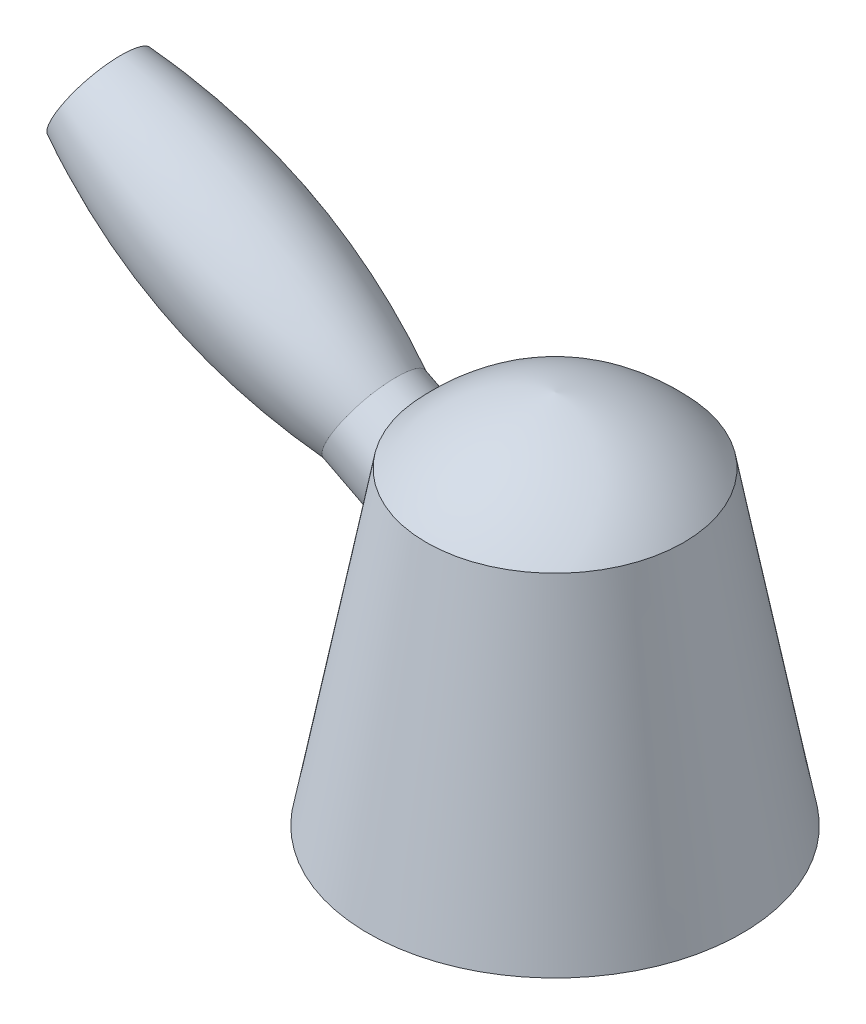
ISO-10303-21;
HEADER;
FILE_DESCRIPTION(('STEP AP214'),'2;1');
FILE_NAME('part.step','',(''),(''),'','','');
FILE_SCHEMA(('AUTOMOTIVE_DESIGN { 1 0 10303 214 1 1 1 1 }'));
ENDSEC;
DATA;
#1=APPLICATION_CONTEXT('core data for automotive mechanical design processes');
#2=APPLICATION_PROTOCOL_DEFINITION('international standard','automotive_design',2000,#1);
#3=PRODUCT_CONTEXT('',#1,'mechanical');
#4=PRODUCT('Part','Part','',(#3));
#5=PRODUCT_RELATED_PRODUCT_CATEGORY('part','',(#4));
#6=PRODUCT_DEFINITION_FORMATION('','',#4);
#7=PRODUCT_DEFINITION_CONTEXT('part definition',#1,'design');
#8=PRODUCT_DEFINITION('design','',#6,#7);
#9=PRODUCT_DEFINITION_SHAPE('','',#8);
#10=(LENGTH_UNIT() NAMED_UNIT(*) SI_UNIT(.MILLI.,.METRE.));
#11=(NAMED_UNIT(*) PLANE_ANGLE_UNIT() SI_UNIT($,.RADIAN.));
#12=(NAMED_UNIT(*) SI_UNIT($,.STERADIAN.) SOLID_ANGLE_UNIT());
#13=UNCERTAINTY_MEASURE_WITH_UNIT(LENGTH_MEASURE(1.E-05),#10,'distance_accuracy_value','');
#14=(GEOMETRIC_REPRESENTATION_CONTEXT(3) GLOBAL_UNCERTAINTY_ASSIGNED_CONTEXT((#13)) GLOBAL_UNIT_ASSIGNED_CONTEXT((#10,
#11,#12)) REPRESENTATION_CONTEXT('',''));
#15=CARTESIAN_POINT('',(0.,0.,0.));
#16=DIRECTION('',(0.,0.,1.));
#17=DIRECTION('',(1.,0.,0.));
#18=AXIS2_PLACEMENT_3D('',#15,#16,#17);
#19=CARTESIAN_POINT('',(-21.3466135458167,51.3227091633466,0.));
#20=CARTESIAN_POINT('',(-12.7327519919958,60.5934654438864,0.));
#21=CARTESIAN_POINT('',(0.,62.2231075697211,0.));
#22=B_SPLINE_CURVE_WITH_KNOTS('',2,(#19,#20,#21),.UNSPECIFIED.,.F.,.F.,(3,3),(0.,1.),.UNSPECIFIED.);
#23=CARTESIAN_POINT('',(0.,62.2231075697211,0.));
#24=DIRECTION('',(0.,1.,0.));
#25=AXIS1_PLACEMENT('',#23,#24);
#26=SURFACE_OF_REVOLUTION('',#22,#25);
#27=CARTESIAN_POINT('',(0.,62.2231075697211,0.));
#28=VERTEX_POINT('',#27);
#29=VERTEX_LOOP('',#28);
#30=FACE_BOUND('',#29,.T.);
#31=CARTESIAN_POINT('',(0.,51.3227091633466,0.));
#32=DIRECTION('',(0.,1.,0.));
#33=DIRECTION('',(-1.,0.,0.));
#34=AXIS2_PLACEMENT_3D('',#31,#32,#33);
#35=CIRCLE('',#34,21.3466135458167);
#36=CARTESIAN_POINT('',(-21.3466135458167,51.3227091633466,0.));
#37=VERTEX_POINT('',#36);
#38=EDGE_CURVE('E11',#37,#37,#35,.T.);
#39=ORIENTED_EDGE('',*,*,#38,.T.);
#40=EDGE_LOOP('',(#39));
#41=FACE_BOUND('',#40,.T.);
#42=ADVANCED_FACE('F39',(#30,#41),#26,.T.);
#43=CARTESIAN_POINT('',(0.,0.,0.));
#44=DIRECTION('',(0.,-1.,0.));
#45=DIRECTION('',(1.,0.,0.));
#46=AXIS2_PLACEMENT_3D('',#43,#44,#45);
#47=CONICAL_SURFACE('',#46,31.,0.185919697183618);
#48=CARTESIAN_POINT('',(-24.1161501733399,34.0757030325233,-4.80735627525185));
#49=CARTESIAN_POINT('',(-24.0589873401111,34.1948385170334,-4.97948805248401));
#50=CARTESIAN_POINT('',(-23.9995697616349,34.3208311605628,-5.14621009731383));
#51=CARTESIAN_POINT('',(-23.8772410562156,34.5859305183616,-5.46763375845816));
#52=CARTESIAN_POINT('',(-23.8143279268493,34.7250447818414,-5.62232836055807));
#53=CARTESIAN_POINT('',(-23.6859700742553,35.0159671761574,-5.91885726500743));
#54=CARTESIAN_POINT('',(-23.6205202966762,35.1678014331521,-6.06066378643435));
#55=CARTESIAN_POINT('',(-23.4883465077628,35.4830959037464,-6.3300425571355));
#56=CARTESIAN_POINT('',(-23.4216225034295,35.6465560534816,-6.45761488459213));
#57=CARTESIAN_POINT('',(-23.2880597933237,35.9841424752919,-6.697622350267));
#58=CARTESIAN_POINT('',(-23.2212211122437,36.1582666773936,-6.8100604126962));
#59=CARTESIAN_POINT('',(-23.0885489421428,36.5161582644356,-7.0190821608874));
#60=CARTESIAN_POINT('',(-23.0227154881462,36.6999259843918,-7.11566529536727));
#61=CARTESIAN_POINT('',(-22.8931898029493,37.0757821443392,-7.29231606978475));
#62=CARTESIAN_POINT('',(-22.8294960815663,37.2678645709852,-7.3723954118393));
#63=CARTESIAN_POINT('',(-22.7052023198652,37.6591769226697,-7.51570589413672));
#64=CARTESIAN_POINT('',(-22.6446022256677,37.8584067231249,-7.57893732788734));
#65=CARTESIAN_POINT('',(-22.5280156649117,38.2604260286369,-7.68772471473032));
#66=CARTESIAN_POINT('',(-22.4719860419005,38.4631528995176,-7.73346615376614));
#67=CARTESIAN_POINT('',(-22.3645205178933,38.8728590212299,-7.80819990875397));
#68=CARTESIAN_POINT('',(-22.3130845784492,39.0798382364526,-7.83719236490232));
#69=CARTESIAN_POINT('',(-22.2153482941029,39.4966462372187,-7.87855561139602));
#70=CARTESIAN_POINT('',(-22.1690480208931,39.7064750624959,-7.89092616973141));
#71=CARTESIAN_POINT('',(-22.0819364462416,40.1276642938344,-7.8993235053111));
#72=CARTESIAN_POINT('',(-22.0411272458578,40.3390252537235,-7.89534404478365));
#73=CARTESIAN_POINT('',(-21.9641267860377,40.7679373120569,-7.87107447262709));
#74=CARTESIAN_POINT('',(-21.9281015685216,40.9854920629697,-7.85031977067011));
#75=CARTESIAN_POINT('',(-21.8621163433967,41.4193664348352,-7.79243874325677));
#76=CARTESIAN_POINT('',(-21.8321584376166,41.6356856026264,-7.75530675851503));
#77=CARTESIAN_POINT('',(-21.7512603044431,42.280719164139,-7.62019553667005));
#78=CARTESIAN_POINT('',(-21.709247177782,42.7057838094614,-7.49848436591362));
#79=CARTESIAN_POINT('',(-21.6439435620018,43.5727942258543,-7.18311130275072));
#80=CARTESIAN_POINT('',(-21.6226299070347,44.0129251942495,-6.98405275187126));
#81=CARTESIAN_POINT('',(-21.6058898817571,44.6470970770069,-6.63765821491089));
#82=CARTESIAN_POINT('',(-21.6028519147674,44.8543035221287,-6.51410913942469));
#83=CARTESIAN_POINT('',(-21.6011070689309,45.2587950570205,-6.25152557570576));
#84=CARTESIAN_POINT('',(-21.6024008699725,45.4560785844158,-6.11248865990496));
#85=CARTESIAN_POINT('',(-21.6087659807262,45.8531709708044,-5.80882893001133));
#86=CARTESIAN_POINT('',(-21.6141058461551,46.0521151071053,-5.64307972743327));
#87=CARTESIAN_POINT('',(-21.6278559332783,46.4349169281842,-5.29510895305184));
#88=CARTESIAN_POINT('',(-21.6362658817653,46.6187759536068,-5.11288884808273));
#89=CARTESIAN_POINT('',(-21.6550953581274,46.969194748823,-4.73288159180835));
#90=CARTESIAN_POINT('',(-21.6655130776809,47.1357698794162,-4.5351085426129));
#91=CARTESIAN_POINT('',(-21.6872907855028,47.4495249663692,-4.12480198404761));
#92=CARTESIAN_POINT('',(-21.6986504911345,47.5967107063229,-3.91227290521883));
#93=CARTESIAN_POINT('',(-21.7187315986065,47.8389590838952,-3.52251634130378));
#94=CARTESIAN_POINT('',(-21.7274775370713,47.9383318913569,-3.34795845582806));
#95=CARTESIAN_POINT('',(-21.7444114602224,48.1227633108617,-2.99142755648769));
#96=CARTESIAN_POINT('',(-21.7525995644167,48.2078249946334,-2.8094561442991));
#97=CARTESIAN_POINT('',(-21.7679606641993,48.3624696861177,-2.43913697741319));
#98=CARTESIAN_POINT('',(-21.7751343332188,48.4320629802118,-2.25079355667079));
#99=CARTESIAN_POINT('',(-21.7880711764065,48.5548074297072,-1.86875421965951));
#100=CARTESIAN_POINT('',(-21.7938343209261,48.6079582395018,-1.67505819097671));
#101=CARTESIAN_POINT('',(-21.8036438507222,48.6971538473605,-1.2827264146136));
#102=CARTESIAN_POINT('',(-21.8076818214522,48.7331149012209,-1.08407134732806));
#103=CARTESIAN_POINT('',(-21.8137628315751,48.7869040390191,-0.684282320567605));
#104=CARTESIAN_POINT('',(-21.8158058727407,48.804732139068,-0.483148363295352));
#105=CARTESIAN_POINT('',(-21.8177751631013,48.8219205477246,-0.0801042609735322));
#106=CARTESIAN_POINT('',(-21.8177016583799,48.8212830032683,0.121805791112863));
#107=CARTESIAN_POINT('',(-21.8154425727082,48.8015562879095,0.524701576991352));
#108=CARTESIAN_POINT('',(-21.8132571008227,48.7824680698232,0.72568735797547));
#109=CARTESIAN_POINT('',(-21.807155926004,48.7284210414754,1.10932302349286));
#110=CARTESIAN_POINT('',(-21.8033900711112,48.69483077206,1.29217018348536));
#111=CARTESIAN_POINT('',(-21.7943648351628,48.6127970611276,1.65452364071118));
#112=CARTESIAN_POINT('',(-21.789104948253,48.5643485884275,1.83402878442157));
#113=CARTESIAN_POINT('',(-21.7773516958927,48.4533030833518,2.18850156107614));
#114=CARTESIAN_POINT('',(-21.7708586576764,48.3907098036661,2.36347038382961));
#115=CARTESIAN_POINT('',(-21.7569485933456,48.2521544363249,2.70805566350788));
#116=CARTESIAN_POINT('',(-21.749531210383,48.176187180877,2.8776700214457));
#117=CARTESIAN_POINT('',(-21.7337385234596,48.007641132387,3.21908881711108));
#118=CARTESIAN_POINT('',(-21.7253338035002,47.9144190160805,3.39057433111699));
#119=CARTESIAN_POINT('',(-21.7083330115605,47.7152615910462,3.72601509965161));
#120=CARTESIAN_POINT('',(-21.699736874959,47.6093219342738,3.88996775210129));
#121=CARTESIAN_POINT('',(-21.6743451449699,47.2740208651467,4.36957814324569));
#122=CARTESIAN_POINT('',(-21.6579385427152,47.0271017401529,4.67313896676247));
#123=CARTESIAN_POINT('',(-21.6277866443387,46.4545265904836,5.287054886081));
#124=CARTESIAN_POINT('',(-21.6148086053516,46.1226163847999,5.59161108539678));
#125=CARTESIAN_POINT('',(-21.6041396567315,45.5944058415615,6.00982484304371));
#126=CARTESIAN_POINT('',(-21.6020512416507,45.4131470382189,6.14286851872794));
#127=CARTESIAN_POINT('',(-21.6014487956726,45.0415293229493,6.39572825230629));
#128=CARTESIAN_POINT('',(-21.6029352924788,44.8511690715956,6.515542354613));
#129=CARTESIAN_POINT('',(-21.6105653136848,44.4372911943711,6.75609938982102));
#130=CARTESIAN_POINT('',(-21.6172886000372,44.2126781742624,6.87494196006096));
#131=CARTESIAN_POINT('',(-21.6368971364134,43.7550248507971,7.09432127909431));
#132=CARTESIAN_POINT('',(-21.6497804729025,43.5219871852068,7.19486369919532));
#133=CARTESIAN_POINT('',(-21.682432036346,43.0489076952448,7.37693724940439));
#134=CARTESIAN_POINT('',(-21.7022040107885,42.8088621237585,7.45845799114125));
#135=CARTESIAN_POINT('',(-21.7491999725808,42.3237078348687,7.60151736907415));
#136=CARTESIAN_POINT('',(-21.7764204919773,42.078601522665,7.66306527530448));
#137=CARTESIAN_POINT('',(-21.8387383926274,41.584851703512,7.76537792544898));
#138=CARTESIAN_POINT('',(-21.873841940188,41.3362055710084,7.80612631733446));
#139=CARTESIAN_POINT('',(-21.9520776857184,40.8375435691897,7.86590150154815));
#140=CARTESIAN_POINT('',(-21.9952100209081,40.5875276765349,7.88492792258661));
#141=CARTESIAN_POINT('',(-22.0893495849841,40.0884321082893,7.9004919155713));
#142=CARTESIAN_POINT('',(-22.1403516417745,39.839351927082,7.89704419690656));
#143=CARTESIAN_POINT('',(-22.2498052165651,39.3442327950347,7.86711852896086));
#144=CARTESIAN_POINT('',(-22.3082559047741,39.0981935087773,7.8406431430937));
#145=CARTESIAN_POINT('',(-22.4259516931088,38.6345793023467,7.76798495703646));
#146=CARTESIAN_POINT('',(-22.4845949216816,38.416519060191,7.72391098279055));
#147=CARTESIAN_POINT('',(-22.6065256987342,37.9864823816031,7.61665008696918));
#148=CARTESIAN_POINT('',(-22.6698129919077,37.7745056116233,7.55346421547059));
#149=CARTESIAN_POINT('',(-22.8000117980984,37.3583280750977,7.40822387188028));
#150=CARTESIAN_POINT('',(-22.8669224941627,37.1541255732582,7.326173639625));
#151=CARTESIAN_POINT('',(-23.0032183760341,36.7549880708537,7.14365773266045));
#152=CARTESIAN_POINT('',(-23.0726034947922,36.5600528195092,7.04319255663278));
#153=CARTESIAN_POINT('',(-23.2083498626385,36.1922975476031,6.83113052395856));
#154=CARTESIAN_POINT('',(-23.2746411818942,36.0188527751737,6.72057011513731));
#155=CARTESIAN_POINT('',(-23.4071766989,35.682425046797,6.4845166536809));
#156=CARTESIAN_POINT('',(-23.4734208974493,35.5194419089875,6.35902386073452));
#157=CARTESIAN_POINT('',(-23.6047393017817,35.2048594291953,6.09396286127777));
#158=CARTESIAN_POINT('',(-23.6698135368151,35.0532598023118,5.95439500723594));
#159=CARTESIAN_POINT('',(-23.7976904228645,34.7622329623249,5.66214203767727));
#160=CARTESIAN_POINT('',(-23.8604930307402,34.6228059803202,5.50945667323253));
#161=CARTESIAN_POINT('',(-23.9830449123439,34.3561991231338,5.19129231715543));
#162=CARTESIAN_POINT('',(-24.0427787365387,34.2290788154251,5.02575746965611));
#163=CARTESIAN_POINT('',(-24.1578846908136,33.988373837772,4.68360670084206));
#164=CARTESIAN_POINT('',(-24.2132553202553,33.874793817925,4.50698700429816));
#165=CARTESIAN_POINT('',(-24.3186727809598,33.6617370445682,4.14395242210178));
#166=CARTESIAN_POINT('',(-24.3687201498257,33.5622588665564,3.95753852842431));
#167=CARTESIAN_POINT('',(-24.4626603328186,33.377816640346,3.57616929318834));
#168=CARTESIAN_POINT('',(-24.5065529432944,33.2928530723924,3.38121366927753));
#169=CARTESIAN_POINT('',(-24.5881847159611,33.1363912841093,2.98048617623214));
#170=CARTESIAN_POINT('',(-24.6257977763725,33.0651653579128,2.77458223554689));
#171=CARTESIAN_POINT('',(-24.6932363528265,32.9384352905726,2.3567475607746));
#172=CARTESIAN_POINT('',(-24.7230617771845,32.8829313345245,2.14481675576531));
#173=CARTESIAN_POINT('',(-24.7744110541666,32.7878841093149,1.71643611437779));
#174=CARTESIAN_POINT('',(-24.7959355533748,32.7483395970132,1.499986631358));
#175=CARTESIAN_POINT('',(-24.8303171429427,32.6853724057427,1.06407982850159));
#176=CARTESIAN_POINT('',(-24.8431744013508,32.6619494141954,0.844622567066632));
#177=CARTESIAN_POINT('',(-24.8600435325234,32.6312470889635,0.403153855994998));
#178=CARTESIAN_POINT('',(-24.8640114912093,32.6240479015507,0.18113514836568));
#179=CARTESIAN_POINT('',(-24.8629041753153,32.6260594197573,-0.262729440684382));
#180=CARTESIAN_POINT('',(-24.8578319750748,32.6352645466662,-0.484575355200912));
#181=CARTESIAN_POINT('',(-24.8387303896064,32.6700484657265,-0.926768616535547));
#182=CARTESIAN_POINT('',(-24.8246939239369,32.695640200912,-1.14711463949562));
#183=CARTESIAN_POINT('',(-24.7879006993073,32.7630994288191,-1.58455455318599));
#184=CARTESIAN_POINT('',(-24.7651442755053,32.8049662959947,-1.80164856857645));
#185=CARTESIAN_POINT('',(-24.7112829536842,32.9048386503136,-2.23122843171311));
#186=CARTESIAN_POINT('',(-24.6801711224327,32.9628575417134,-2.44371029335972));
#187=CARTESIAN_POINT('',(-24.6101480782388,33.0947707371035,-2.86236383304745));
#188=CARTESIAN_POINT('',(-24.5712370847955,33.1686645943142,-3.06853568848873));
#189=CARTESIAN_POINT('',(-24.4863915352196,33.3318195583967,-3.47264377960165));
#190=CARTESIAN_POINT('',(-24.4404728654991,33.4210459626055,-3.67059738629782));
#191=CARTESIAN_POINT('',(-24.3423657914469,33.6145547770809,-4.05726971914934));
#192=CARTESIAN_POINT('',(-24.2901812162388,33.7188279999514,-4.24599398714965));
#193=CARTESIAN_POINT('',(-24.2160972352834,33.8694792124067,-4.49373681754288));
#194=CARTESIAN_POINT('',(-24.1965356300272,33.9094849990516,-4.55740450429384));
#195=CARTESIAN_POINT('',(-24.1567957737832,33.9912684666753,-4.68339809118575));
#196=CARTESIAN_POINT('',(-24.136617505041,34.0330461986837,-4.74572395260593));
#197=CARTESIAN_POINT('',(-24.1161501733399,34.0757030325233,-4.80735627525185));
#198=B_SPLINE_CURVE_WITH_KNOTS('',3,(#48,#49,#50,#51,#52,#53,#54,#55,#56,#57,#58,#59,#60,#61,
#62,#63,#64,#65,#66,#67,#68,#69,#70,#71,#72,#73,#74,#75,#76,#77,#78,#79,#80,#81,#82,#83,#84,#85,
#86,#87,#88,#89,#90,#91,#92,#93,#94,#95,#96,#97,#98,#99,#100,#101,#102,#103,#104,#105,#106,#107,
#108,#109,#110,#111,#112,#113,#114,#115,#116,#117,#118,#119,#120,#121,#122,#123,#124,#125,#126,
#127,#128,#129,#130,#131,#132,#133,#134,#135,#136,#137,#138,#139,#140,#141,#142,#143,#144,#145,
#146,#147,#148,#149,#150,#151,#152,#153,#154,#155,#156,#157,#158,#159,#160,#161,#162,#163,#164,
#165,#166,#167,#168,#169,#170,#171,#172,#173,#174,#175,#176,#177,#178,#179,#180,#181,#182,#183,
#184,#185,#186,#187,#188,#189,#190,#191,#192,#193,#194,#195,#196,#197),.UNSPECIFIED.,.T.,.F.,(4,
2,2,2,2,2,2,2,2,2,2,2,2,2,2,2,2,2,2,2,2,2,2,2,2,2,2,2,2,2,2,2,2,2,2,2,2,2,2,2,2,2,2,2,2,2,2,2,2,
2,2,2,2,2,2,2,2,2,2,2,2,2,2,2,2,2,2,2,2,2,2,2,2,2,4),(0.,0.650936131837664,1.30224907545373,
1.95493421552265,2.60761577049139,3.26017103411269,3.91274898253619,4.56486261234377,
5.21696488092414,5.86194579991643,6.50692132005668,7.15190584273065,7.79713645929555,
8.46087526403718,9.12484360831406,10.4519526708002,11.8960450719392,12.6192338099694,
13.3425360607097,14.1185773491365,14.8945495943191,15.6698261901371,16.4448710052259,
17.0474332267728,17.6498659493699,18.2518968513985,18.8539404067298,19.4588878077966,
20.0638346713679,20.668711200159,21.2735564940232,21.8307588485961,22.3881500879291,
22.9453936217598,23.5028529526731,24.0883504317952,24.6740486619037,25.8449439516334,
27.1913055929062,27.8653864885859,28.5395668934712,29.3013071101759,30.0628108563587,
30.8247295167257,31.5862940387038,32.3484563639896,33.1106317165842,33.8723082733299,
34.6339000519551,35.3232120060289,36.0124860936844,36.701605415561,37.3907060786589,
38.0382567266453,38.6857961147373,39.333319291133,39.9808547581387,40.6313823104217,
41.2821326315973,41.9328171701147,42.583523233674,43.246036040576,43.9085566469507,
44.5710256371757,45.2334817824934,45.8992033812765,46.5646986274468,47.2307201674471,
47.8967161109778,48.5632664079078,49.22979794813,49.8948403107814,50.5594783118585,
50.7925413187489,51.0256110420993),.UNSPECIFIED.);
#199=CARTESIAN_POINT('',(-24.1161501733399,34.0757030325233,-4.80735627525185));
#200=VERTEX_POINT('',#199);
#201=EDGE_CURVE('E43',#200,#200,#198,.T.);
#202=ORIENTED_EDGE('',*,*,#201,.T.);
#203=EDGE_LOOP('',(#202));
#204=FACE_BOUND('',#203,.T.);
#205=ORIENTED_EDGE('',*,*,#38,.F.);
#206=EDGE_LOOP('',(#205));
#207=FACE_BOUND('',#206,.T.);
#208=CARTESIAN_POINT('',(0.,0.,0.));
#209=DIRECTION('',(0.,1.,0.));
#210=DIRECTION('',(-1.,0.,0.));
#211=AXIS2_PLACEMENT_3D('',#208,#209,#210);
#212=CIRCLE('',#211,31.);
#213=CARTESIAN_POINT('',(-31.,0.,0.));
#214=VERTEX_POINT('',#213);
#215=EDGE_CURVE('E50',#214,#214,#212,.T.);
#216=ORIENTED_EDGE('',*,*,#215,.T.);
#217=EDGE_LOOP('',(#216));
#218=FACE_BOUND('',#217,.T.);
#219=ADVANCED_FACE('F55',(#204,#207,#218),#47,.T.);
#220=CARTESIAN_POINT('',(0.,0.,0.));
#221=DIRECTION('',(0.,1.,0.));
#222=DIRECTION('',(-1.,0.,0.));
#223=AXIS2_PLACEMENT_3D('',#220,#221,#222);
#224=PLANE('',#223);
#225=ORIENTED_EDGE('',*,*,#215,.F.);
#226=EDGE_LOOP('',(#225));
#227=FACE_BOUND('',#226,.T.);
#228=CARTESIAN_POINT('',(0.,0.,0.));
#229=DIRECTION('',(0.,1.,0.));
#230=DIRECTION('',(-1.,0.,0.));
#231=AXIS2_PLACEMENT_3D('',#228,#229,#230);
#232=CIRCLE('',#231,13.);
#233=CARTESIAN_POINT('',(-13.,0.,0.));
#234=VERTEX_POINT('',#233);
#235=EDGE_CURVE('E65',#234,#234,#232,.T.);
#236=ORIENTED_EDGE('',*,*,#235,.T.);
#237=EDGE_LOOP('',(#236));
#238=FACE_BOUND('',#237,.T.);
#239=ADVANCED_FACE('F60',(#227,#238),#224,.F.);
#240=CARTESIAN_POINT('',(0.,62.2231075697211,0.));
#241=DIRECTION('',(0.,1.,0.));
#242=DIRECTION('',(-1.,0.,0.));
#243=AXIS2_PLACEMENT_3D('',#240,#241,#242);
#244=CYLINDRICAL_SURFACE('',#243,13.);
#245=CARTESIAN_POINT('',(0.,38.,0.));
#246=DIRECTION('',(0.,1.,0.));
#247=DIRECTION('',(-1.,0.,0.));
#248=AXIS2_PLACEMENT_3D('',#245,#246,#247);
#249=CIRCLE('',#248,13.);
#250=CARTESIAN_POINT('',(-13.,38.,0.));
#251=VERTEX_POINT('',#250);
#252=EDGE_CURVE('E68',#251,#251,#249,.T.);
#253=ORIENTED_EDGE('',*,*,#252,.T.);
#254=EDGE_LOOP('',(#253));
#255=FACE_BOUND('',#254,.T.);
#256=ORIENTED_EDGE('',*,*,#235,.F.);
#257=EDGE_LOOP('',(#256));
#258=FACE_BOUND('',#257,.T.);
#259=ADVANCED_FACE('F105',(#255,#258),#244,.F.);
#260=CARTESIAN_POINT('',(0.,38.,0.));
#261=DIRECTION('',(0.,-1.,0.));
#262=DIRECTION('',(1.,0.,0.));
#263=AXIS2_PLACEMENT_3D('',#260,#261,#262);
#264=PLANE('',#263);
#265=ORIENTED_EDGE('',*,*,#252,.F.);
#266=EDGE_LOOP('',(#265));
#267=FACE_BOUND('',#266,.T.);
#268=ADVANCED_FACE('F101',(#267),#264,.T.);
#269=CARTESIAN_POINT('',(-19.1245497021369,38.5527422144193,0.));
#270=DIRECTION('',(0.889184527620125,-0.457548768811561,0.));
#271=DIRECTION('',(0.457548768811561,0.889184527620125,0.));
#272=AXIS2_PLACEMENT_3D('',#269,#270,#271);
#273=CYLINDRICAL_SURFACE('',#272,7.89674468254391);
#274=CARTESIAN_POINT('',(-30.0061374384112,44.1520941113456,0.));
#275=DIRECTION('',(0.889184527620125,-0.457548768811561,0.));
#276=DIRECTION('',(0.457548768811561,0.889184527620125,0.));
#277=AXIS2_PLACEMENT_3D('',#274,#275,#276);
#278=CIRCLE('',#277,7.89674468254392);
#279=CARTESIAN_POINT('',(-26.392991631294,51.1737573016301,0.));
#280=VERTEX_POINT('',#279);
#281=EDGE_CURVE('E76',#280,#280,#278,.T.);
#282=ORIENTED_EDGE('',*,*,#281,.T.);
#283=EDGE_LOOP('',(#282));
#284=FACE_BOUND('',#283,.T.);
#285=ORIENTED_EDGE('',*,*,#201,.F.);
#286=EDGE_LOOP('',(#285));
#287=FACE_BOUND('',#286,.T.);
#288=ADVANCED_FACE('F96',(#284,#287),#273,.T.);
#289=CARTESIAN_POINT('',(-26.392991631294,51.1737573016301,0.));
#290=CARTESIAN_POINT('',(-46.3258337621582,68.784299288381,0.));
#291=CARTESIAN_POINT('',(-72.0085116037078,74.6461911483352,0.));
#292=B_SPLINE_CURVE_WITH_KNOTS('',2,(#289,#290,#291),.UNSPECIFIED.,.F.,.F.,(3,3),(0.,1.),.UNSPECIFIED.);
#293=CARTESIAN_POINT('',(-19.1245497021369,38.5527422144193,0.));
#294=DIRECTION('',(0.889184527620125,-0.457548768811561,0.));
#295=AXIS1_PLACEMENT('',#293,#294);
#296=SURFACE_OF_REVOLUTION('',#292,#295);
#297=CARTESIAN_POINT('',(-75.621657410825,67.6245279580507,0.));
#298=DIRECTION('',(0.889184527620125,-0.457548768811561,0.));
#299=DIRECTION('',(0.457548768811561,0.889184527620125,0.));
#300=AXIS2_PLACEMENT_3D('',#297,#298,#299);
#301=CIRCLE('',#300,7.89674468254393);
#302=CARTESIAN_POINT('',(-72.0085116037078,74.6461911483352,0.));
#303=VERTEX_POINT('',#302);
#304=EDGE_CURVE('E82',#303,#303,#301,.T.);
#305=ORIENTED_EDGE('',*,*,#304,.T.);
#306=EDGE_LOOP('',(#305));
#307=FACE_BOUND('',#306,.T.);
#308=ORIENTED_EDGE('',*,*,#281,.F.);
#309=EDGE_LOOP('',(#308));
#310=FACE_BOUND('',#309,.T.);
#311=ADVANCED_FACE('F92',(#307,#310),#296,.F.);
#312=CARTESIAN_POINT('',(-75.621657410825,67.6245279580507,0.));
#313=DIRECTION('',(-0.889184527620125,0.457548768811561,0.));
#314=DIRECTION('',(-0.457548768811561,-0.889184527620125,0.));
#315=AXIS2_PLACEMENT_3D('',#312,#313,#314);
#316=PLANE('',#315);
#317=ORIENTED_EDGE('',*,*,#304,.F.);
#318=EDGE_LOOP('',(#317));
#319=FACE_BOUND('',#318,.T.);
#320=ADVANCED_FACE('F95',(#319),#316,.T.);
#321=CLOSED_SHELL('',(#42,#219,#239,#259,#268,#288,#311,#320));
#322=MANIFOLD_SOLID_BREP('B2',#321);
#323=ADVANCED_BREP_SHAPE_REPRESENTATION('',(#18,#322),#14);
#324=SHAPE_DEFINITION_REPRESENTATION(#9,#323);
ENDSEC;
END-ISO-10303-21;
